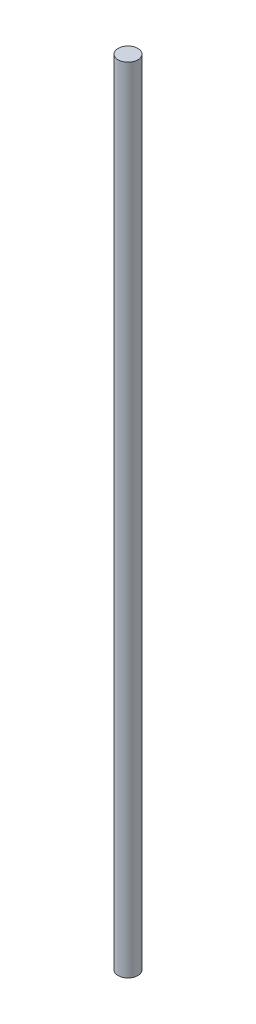
ISO-10303-21;
HEADER;
FILE_DESCRIPTION(('STEP AP214'),'2;1');
FILE_NAME('part.step','',(''),(''),'','','');
FILE_SCHEMA(('AUTOMOTIVE_DESIGN { 1 0 10303 214 1 1 1 1 }'));
ENDSEC;
DATA;
#1=APPLICATION_CONTEXT('core data for automotive mechanical design processes');
#2=APPLICATION_PROTOCOL_DEFINITION('international standard','automotive_design',2000,#1);
#3=PRODUCT_CONTEXT('',#1,'mechanical');
#4=PRODUCT('Part','Part','',(#3));
#5=PRODUCT_RELATED_PRODUCT_CATEGORY('part','',(#4));
#6=PRODUCT_DEFINITION_FORMATION('','',#4);
#7=PRODUCT_DEFINITION_CONTEXT('part definition',#1,'design');
#8=PRODUCT_DEFINITION('design','',#6,#7);
#9=PRODUCT_DEFINITION_SHAPE('','',#8);
#10=(LENGTH_UNIT() NAMED_UNIT(*) SI_UNIT(.MILLI.,.METRE.));
#11=(NAMED_UNIT(*) PLANE_ANGLE_UNIT() SI_UNIT($,.RADIAN.));
#12=(NAMED_UNIT(*) SI_UNIT($,.STERADIAN.) SOLID_ANGLE_UNIT());
#13=UNCERTAINTY_MEASURE_WITH_UNIT(LENGTH_MEASURE(1.E-05),#10,'distance_accuracy_value','');
#14=(GEOMETRIC_REPRESENTATION_CONTEXT(3) GLOBAL_UNCERTAINTY_ASSIGNED_CONTEXT((#13)) GLOBAL_UNIT_ASSIGNED_CONTEXT((#10,
#11,#12)) REPRESENTATION_CONTEXT('',''));
#15=CARTESIAN_POINT('',(0.,0.,0.));
#16=DIRECTION('',(0.,0.,1.));
#17=DIRECTION('',(1.,0.,0.));
#18=AXIS2_PLACEMENT_3D('',#15,#16,#17);
#19=CARTESIAN_POINT('',(0.,120.,0.));
#20=DIRECTION('',(0.,-1.,0.));
#21=DIRECTION('',(0.,0.,-1.));
#22=AXIS2_PLACEMENT_3D('',#19,#20,#21);
#23=CYLINDRICAL_SURFACE('',#22,1.5);
#24=CARTESIAN_POINT('',(0.,120.,0.));
#25=DIRECTION('',(0.,1.,0.));
#26=DIRECTION('',(0.,0.,1.));
#27=AXIS2_PLACEMENT_3D('',#24,#25,#26);
#28=CIRCLE('',#27,1.5);
#29=CARTESIAN_POINT('',(0.,120.,1.5));
#30=VERTEX_POINT('',#29);
#31=EDGE_CURVE('E10',#30,#30,#28,.T.);
#32=ORIENTED_EDGE('',*,*,#31,.F.);
#33=EDGE_LOOP('',(#32));
#34=FACE_BOUND('',#33,.T.);
#35=CARTESIAN_POINT('',(0.,0.,0.));
#36=DIRECTION('',(0.,1.,0.));
#37=DIRECTION('',(0.,0.,1.));
#38=AXIS2_PLACEMENT_3D('',#35,#36,#37);
#39=CIRCLE('',#38,1.5);
#40=CARTESIAN_POINT('',(0.,0.,1.5));
#41=VERTEX_POINT('',#40);
#42=EDGE_CURVE('E33',#41,#41,#39,.T.);
#43=ORIENTED_EDGE('',*,*,#42,.T.);
#44=EDGE_LOOP('',(#43));
#45=FACE_BOUND('',#44,.T.);
#46=ADVANCED_FACE('F30',(#34,#45),#23,.T.);
#47=CARTESIAN_POINT('',(0.,120.,0.));
#48=DIRECTION('',(0.,1.,0.));
#49=DIRECTION('',(0.,0.,1.));
#50=AXIS2_PLACEMENT_3D('',#47,#48,#49);
#51=PLANE('',#50);
#52=ORIENTED_EDGE('',*,*,#31,.T.);
#53=EDGE_LOOP('',(#52));
#54=FACE_BOUND('',#53,.T.);
#55=ADVANCED_FACE('F45',(#54),#51,.T.);
#56=CARTESIAN_POINT('',(0.,0.,0.));
#57=DIRECTION('',(0.,1.,0.));
#58=DIRECTION('',(0.,0.,1.));
#59=AXIS2_PLACEMENT_3D('',#56,#57,#58);
#60=PLANE('',#59);
#61=ORIENTED_EDGE('',*,*,#42,.F.);
#62=EDGE_LOOP('',(#61));
#63=FACE_BOUND('',#62,.T.);
#64=ADVANCED_FACE('F43',(#63),#60,.F.);
#65=CLOSED_SHELL('',(#46,#55,#64));
#66=MANIFOLD_SOLID_BREP('B2',#65);
#67=ADVANCED_BREP_SHAPE_REPRESENTATION('',(#18,#66),#14);
#68=SHAPE_DEFINITION_REPRESENTATION(#9,#67);
ENDSEC;
END-ISO-10303-21;
